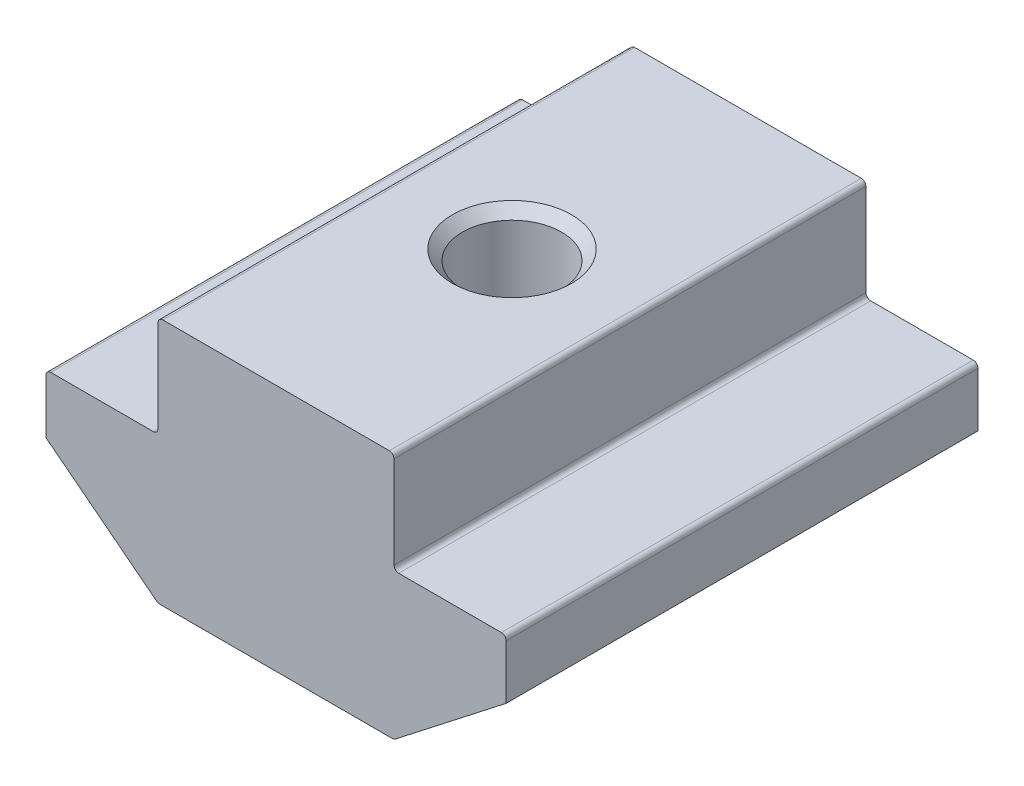
ISO-10303-21;
HEADER;
FILE_DESCRIPTION(('STEP AP214'),'2;1');
FILE_NAME('part.step','',(''),(''),'','','');
FILE_SCHEMA(('AUTOMOTIVE_DESIGN { 1 0 10303 214 1 1 1 1 }'));
ENDSEC;
DATA;
#1=APPLICATION_CONTEXT('core data for automotive mechanical design processes');
#2=APPLICATION_PROTOCOL_DEFINITION('international standard','automotive_design',2000,#1);
#3=PRODUCT_CONTEXT('',#1,'mechanical');
#4=PRODUCT('Part','Part','',(#3));
#5=PRODUCT_RELATED_PRODUCT_CATEGORY('part','',(#4));
#6=PRODUCT_DEFINITION_FORMATION('','',#4);
#7=PRODUCT_DEFINITION_CONTEXT('part definition',#1,'design');
#8=PRODUCT_DEFINITION('design','',#6,#7);
#9=PRODUCT_DEFINITION_SHAPE('','',#8);
#10=(LENGTH_UNIT() NAMED_UNIT(*) SI_UNIT(.MILLI.,.METRE.));
#11=(NAMED_UNIT(*) PLANE_ANGLE_UNIT() SI_UNIT($,.RADIAN.));
#12=(NAMED_UNIT(*) SI_UNIT($,.STERADIAN.) SOLID_ANGLE_UNIT());
#13=UNCERTAINTY_MEASURE_WITH_UNIT(LENGTH_MEASURE(1.E-05),#10,'distance_accuracy_value','');
#14=(GEOMETRIC_REPRESENTATION_CONTEXT(3) GLOBAL_UNCERTAINTY_ASSIGNED_CONTEXT((#13)) GLOBAL_UNIT_ASSIGNED_CONTEXT((#10,
#11,#12)) REPRESENTATION_CONTEXT('',''));
#15=CARTESIAN_POINT('',(0.,0.,0.));
#16=DIRECTION('',(0.,0.,1.));
#17=DIRECTION('',(1.,0.,0.));
#18=AXIS2_PLACEMENT_3D('',#15,#16,#17);
#19=CARTESIAN_POINT('',(-5.,0.,10.));
#20=DIRECTION('',(1.,0.,0.));
#21=DIRECTION('',(0.,1.,0.));
#22=AXIS2_PLACEMENT_3D('',#19,#20,#21);
#23=PLANE('',#22);
#24=DIRECTION('',(0.,-1.,0.));
#25=VECTOR('',#24,1.);
#26=CARTESIAN_POINT('',(-5.,0.,10.));
#27=LINE('',#26,#25);
#28=CARTESIAN_POINT('',(-5.,-0.200000000000003,10.));
#29=VERTEX_POINT('',#28);
#30=CARTESIAN_POINT('',(-5.,-4.1,10.));
#31=VERTEX_POINT('',#30);
#32=EDGE_CURVE('E234',#29,#31,#27,.T.);
#33=ORIENTED_EDGE('',*,*,#32,.F.);
#34=DIRECTION('',(0.,0.,-1.));
#35=VECTOR('',#34,1.);
#36=CARTESIAN_POINT('',(-5.,-0.200000000000003,10.));
#37=LINE('',#36,#35);
#38=CARTESIAN_POINT('',(-5.,-0.200000000000003,-10.));
#39=VERTEX_POINT('',#38);
#40=EDGE_CURVE('E285',#29,#39,#37,.T.);
#41=ORIENTED_EDGE('',*,*,#40,.T.);
#42=DIRECTION('',(0.,-1.,0.));
#43=VECTOR('',#42,1.);
#44=CARTESIAN_POINT('',(-5.,0.,-10.));
#45=LINE('',#44,#43);
#46=CARTESIAN_POINT('',(-5.,-4.1,-10.));
#47=VERTEX_POINT('',#46);
#48=EDGE_CURVE('E208',#39,#47,#45,.T.);
#49=ORIENTED_EDGE('',*,*,#48,.T.);
#50=DIRECTION('',(0.,0.,-1.));
#51=VECTOR('',#50,1.);
#52=CARTESIAN_POINT('',(-5.,-4.1,10.));
#53=LINE('',#52,#51);
#54=EDGE_CURVE('E283',#47,#31,#53,.F.);
#55=ORIENTED_EDGE('',*,*,#54,.T.);
#56=EDGE_LOOP('',(#33,#41,#49,#55));
#57=FACE_BOUND('',#56,.T.);
#58=ADVANCED_FACE('F37',(#57),#23,.F.);
#59=CARTESIAN_POINT('',(-5.,-4.3,10.));
#60=DIRECTION('',(0.,-1.,0.));
#61=DIRECTION('',(1.,0.,0.));
#62=AXIS2_PLACEMENT_3D('',#59,#60,#61);
#63=PLANE('',#62);
#64=DIRECTION('',(-1.,0.,0.));
#65=VECTOR('',#64,1.);
#66=CARTESIAN_POINT('',(-5.,-4.3,-10.));
#67=LINE('',#66,#65);
#68=CARTESIAN_POINT('',(-5.2,-4.3,-10.));
#69=VERTEX_POINT('',#68);
#70=CARTESIAN_POINT('',(-9.55,-4.3,-10.));
#71=VERTEX_POINT('',#70);
#72=EDGE_CURVE('E211',#69,#71,#67,.T.);
#73=ORIENTED_EDGE('',*,*,#72,.T.);
#74=DIRECTION('',(0.,0.,-1.));
#75=VECTOR('',#74,1.);
#76=CARTESIAN_POINT('',(-9.55,-4.3,10.));
#77=LINE('',#76,#75);
#78=CARTESIAN_POINT('',(-9.55,-4.3,10.));
#79=VERTEX_POINT('',#78);
#80=EDGE_CURVE('E293',#71,#79,#77,.F.);
#81=ORIENTED_EDGE('',*,*,#80,.T.);
#82=DIRECTION('',(-1.,0.,0.));
#83=VECTOR('',#82,1.);
#84=CARTESIAN_POINT('',(-5.,-4.3,10.));
#85=LINE('',#84,#83);
#86=CARTESIAN_POINT('',(-5.2,-4.3,10.));
#87=VERTEX_POINT('',#86);
#88=EDGE_CURVE('E175',#87,#79,#85,.T.);
#89=ORIENTED_EDGE('',*,*,#88,.F.);
#90=DIRECTION('',(0.,0.,-1.));
#91=VECTOR('',#90,1.);
#92=CARTESIAN_POINT('',(-5.2,-4.3,-10.));
#93=LINE('',#92,#91);
#94=EDGE_CURVE('E290',#87,#69,#93,.T.);
#95=ORIENTED_EDGE('',*,*,#94,.T.);
#96=EDGE_LOOP('',(#73,#81,#89,#95));
#97=FACE_BOUND('',#96,.T.);
#98=ADVANCED_FACE('F313',(#97),#63,.F.);
#99=CARTESIAN_POINT('',(-9.75,-4.3,10.));
#100=DIRECTION('',(1.,0.,0.));
#101=DIRECTION('',(0.,0.,-1.));
#102=AXIS2_PLACEMENT_3D('',#99,#100,#101);
#103=PLANE('',#102);
#104=DIRECTION('',(0.,-1.,0.));
#105=VECTOR('',#104,1.);
#106=CARTESIAN_POINT('',(-9.75,-4.3,10.));
#107=LINE('',#106,#105);
#108=CARTESIAN_POINT('',(-9.75,-4.5,10.));
#109=VERTEX_POINT('',#108);
#110=CARTESIAN_POINT('',(-9.75,-6.8,10.));
#111=VERTEX_POINT('',#110);
#112=EDGE_CURVE('E162',#109,#111,#107,.T.);
#113=ORIENTED_EDGE('',*,*,#112,.F.);
#114=DIRECTION('',(0.,0.,-1.));
#115=VECTOR('',#114,1.);
#116=CARTESIAN_POINT('',(-9.75,-4.5,10.));
#117=LINE('',#116,#115);
#118=CARTESIAN_POINT('',(-9.75,-4.5,-10.));
#119=VERTEX_POINT('',#118);
#120=EDGE_CURVE('E288',#109,#119,#117,.T.);
#121=ORIENTED_EDGE('',*,*,#120,.T.);
#122=DIRECTION('',(0.,-1.,0.));
#123=VECTOR('',#122,1.);
#124=CARTESIAN_POINT('',(-9.75,-4.3,-10.));
#125=LINE('',#124,#123);
#126=CARTESIAN_POINT('',(-9.75,-6.8,-10.));
#127=VERTEX_POINT('',#126);
#128=EDGE_CURVE('E181',#119,#127,#125,.T.);
#129=ORIENTED_EDGE('',*,*,#128,.T.);
#130=DIRECTION('',(0.,0.,-1.));
#131=VECTOR('',#130,1.);
#132=CARTESIAN_POINT('',(-9.75,-6.8,10.));
#133=LINE('',#132,#131);
#134=EDGE_CURVE('E178',#111,#127,#133,.T.);
#135=ORIENTED_EDGE('',*,*,#134,.F.);
#136=EDGE_LOOP('',(#113,#121,#129,#135));
#137=FACE_BOUND('',#136,.T.);
#138=ADVANCED_FACE('F179',(#137),#103,.F.);
#139=CARTESIAN_POINT('',(-9.75,-6.8,10.));
#140=DIRECTION('',(0.614515361098146,0.788904855463836,0.));
#141=DIRECTION('',(-0.788904855463836,0.614515361098146,0.));
#142=AXIS2_PLACEMENT_3D('',#139,#140,#141);
#143=PLANE('',#142);
#144=DIRECTION('',(0.788904855463836,-0.614515361098146,0.));
#145=VECTOR('',#144,1.);
#146=CARTESIAN_POINT('',(-9.75,-6.8,-10.));
#147=LINE('',#146,#145);
#148=CARTESIAN_POINT('',(-5.05420010467821,-10.4577809710928,-10.));
#149=VERTEX_POINT('',#148);
#150=EDGE_CURVE('E216',#127,#149,#147,.T.);
#151=ORIENTED_EDGE('',*,*,#150,.T.);
#152=DIRECTION('',(0.,0.,-1.));
#153=VECTOR('',#152,1.);
#154=CARTESIAN_POINT('',(-5.05420010467821,-10.4577809710928,10.));
#155=LINE('',#154,#153);
#156=CARTESIAN_POINT('',(-5.05420010467821,-10.4577809710928,10.));
#157=VERTEX_POINT('',#156);
#158=EDGE_CURVE('E190',#149,#157,#155,.F.);
#159=ORIENTED_EDGE('',*,*,#158,.T.);
#160=DIRECTION('',(0.788904855463836,-0.614515361098146,0.));
#161=VECTOR('',#160,1.);
#162=CARTESIAN_POINT('',(-9.75,-6.8,10.));
#163=LINE('',#162,#161);
#164=EDGE_CURVE('E167',#111,#157,#163,.T.);
#165=ORIENTED_EDGE('',*,*,#164,.F.);
#166=ORIENTED_EDGE('',*,*,#134,.T.);
#167=EDGE_LOOP('',(#151,#159,#165,#166));
#168=FACE_BOUND('',#167,.T.);
#169=ADVANCED_FACE('F188',(#168),#143,.F.);
#170=CARTESIAN_POINT('',(-5.,-10.5,10.));
#171=DIRECTION('',(0.,1.,0.));
#172=DIRECTION('',(0.,0.,1.));
#173=AXIS2_PLACEMENT_3D('',#170,#171,#172);
#174=PLANE('',#173);
#175=CARTESIAN_POINT('',(0.,-10.5,0.));
#176=DIRECTION('',(0.,1.,0.));
#177=DIRECTION('',(0.,0.,1.));
#178=AXIS2_PLACEMENT_3D('',#175,#176,#177);
#179=CIRCLE('',#178,2.525);
#180=CARTESIAN_POINT('',(0.,-10.5,2.525));
#181=VERTEX_POINT('',#180);
#182=EDGE_CURVE('E325',#181,#181,#179,.T.);
#183=ORIENTED_EDGE('',*,*,#182,.T.);
#184=EDGE_LOOP('',(#183));
#185=FACE_BOUND('',#184,.T.);
#186=DIRECTION('',(1.,0.,0.));
#187=VECTOR('',#186,1.);
#188=CARTESIAN_POINT('',(-5.,-10.5,-10.));
#189=LINE('',#188,#187);
#190=CARTESIAN_POINT('',(-4.93129703245858,-10.5,-10.));
#191=VERTEX_POINT('',#190);
#192=CARTESIAN_POINT('',(4.93129703245858,-10.5,-10.));
#193=VERTEX_POINT('',#192);
#194=EDGE_CURVE('E218',#191,#193,#189,.T.);
#195=ORIENTED_EDGE('',*,*,#194,.T.);
#196=DIRECTION('',(0.,0.,-1.));
#197=VECTOR('',#196,1.);
#198=CARTESIAN_POINT('',(4.93129703245858,-10.5,10.));
#199=LINE('',#198,#197);
#200=CARTESIAN_POINT('',(4.93129703245858,-10.5,10.));
#201=VERTEX_POINT('',#200);
#202=EDGE_CURVE('E254',#193,#201,#199,.F.);
#203=ORIENTED_EDGE('',*,*,#202,.T.);
#204=DIRECTION('',(1.,0.,0.));
#205=VECTOR('',#204,1.);
#206=CARTESIAN_POINT('',(-5.,-10.5,10.));
#207=LINE('',#206,#205);
#208=CARTESIAN_POINT('',(-4.93129703245858,-10.5,10.));
#209=VERTEX_POINT('',#208);
#210=EDGE_CURVE('E191',#209,#201,#207,.T.);
#211=ORIENTED_EDGE('',*,*,#210,.F.);
#212=DIRECTION('',(0.,0.,-1.));
#213=VECTOR('',#212,1.);
#214=CARTESIAN_POINT('',(-4.93129703245858,-10.5,10.));
#215=LINE('',#214,#213);
#216=EDGE_CURVE('E251',#209,#191,#215,.T.);
#217=ORIENTED_EDGE('',*,*,#216,.T.);
#218=EDGE_LOOP('',(#195,#203,#211,#217));
#219=FACE_BOUND('',#218,.T.);
#220=ADVANCED_FACE('F329',(#185,#219),#174,.F.);
#221=CARTESIAN_POINT('',(9.75,-6.8,10.));
#222=DIRECTION('',(-0.614515361098146,0.788904855463836,0.));
#223=DIRECTION('',(-0.788904855463836,-0.614515361098146,0.));
#224=AXIS2_PLACEMENT_3D('',#221,#222,#223);
#225=PLANE('',#224);
#226=DIRECTION('',(0.788904855463836,0.614515361098146,0.));
#227=VECTOR('',#226,1.);
#228=CARTESIAN_POINT('',(9.75,-6.8,10.));
#229=LINE('',#228,#227);
#230=CARTESIAN_POINT('',(5.05420010467821,-10.4577809710928,10.));
#231=VERTEX_POINT('',#230);
#232=CARTESIAN_POINT('',(9.75,-6.8,10.));
#233=VERTEX_POINT('',#232);
#234=EDGE_CURVE('E193',#231,#233,#229,.T.);
#235=ORIENTED_EDGE('',*,*,#234,.F.);
#236=DIRECTION('',(0.,0.,-1.));
#237=VECTOR('',#236,1.);
#238=CARTESIAN_POINT('',(5.05420010467821,-10.4577809710928,10.));
#239=LINE('',#238,#237);
#240=CARTESIAN_POINT('',(5.05420010467821,-10.4577809710928,-10.));
#241=VERTEX_POINT('',#240);
#242=EDGE_CURVE('E185',#231,#241,#239,.T.);
#243=ORIENTED_EDGE('',*,*,#242,.T.);
#244=DIRECTION('',(0.788904855463836,0.614515361098146,0.));
#245=VECTOR('',#244,1.);
#246=CARTESIAN_POINT('',(9.75,-6.8,-10.));
#247=LINE('',#246,#245);
#248=CARTESIAN_POINT('',(9.75,-6.8,-10.));
#249=VERTEX_POINT('',#248);
#250=EDGE_CURVE('E221',#241,#249,#247,.T.);
#251=ORIENTED_EDGE('',*,*,#250,.T.);
#252=DIRECTION('',(0.,0.,-1.));
#253=VECTOR('',#252,1.);
#254=CARTESIAN_POINT('',(9.75,-6.8,10.));
#255=LINE('',#254,#253);
#256=EDGE_CURVE('E186',#233,#249,#255,.T.);
#257=ORIENTED_EDGE('',*,*,#256,.F.);
#258=EDGE_LOOP('',(#235,#243,#251,#257));
#259=FACE_BOUND('',#258,.T.);
#260=ADVANCED_FACE('F385',(#259),#225,.F.);
#261=CARTESIAN_POINT('',(9.75,-4.3,10.));
#262=DIRECTION('',(-1.,0.,0.));
#263=DIRECTION('',(0.,0.,1.));
#264=AXIS2_PLACEMENT_3D('',#261,#262,#263);
#265=PLANE('',#264);
#266=DIRECTION('',(0.,1.,0.));
#267=VECTOR('',#266,1.);
#268=CARTESIAN_POINT('',(9.75,-4.3,-10.));
#269=LINE('',#268,#267);
#270=CARTESIAN_POINT('',(9.75,-4.5,-10.));
#271=VERTEX_POINT('',#270);
#272=EDGE_CURVE('E223',#249,#271,#269,.T.);
#273=ORIENTED_EDGE('',*,*,#272,.T.);
#274=DIRECTION('',(0.,0.,-1.));
#275=VECTOR('',#274,1.);
#276=CARTESIAN_POINT('',(9.75,-4.5,10.));
#277=LINE('',#276,#275);
#278=CARTESIAN_POINT('',(9.75,-4.5,10.));
#279=VERTEX_POINT('',#278);
#280=EDGE_CURVE('E272',#271,#279,#277,.F.);
#281=ORIENTED_EDGE('',*,*,#280,.T.);
#282=DIRECTION('',(0.,1.,0.));
#283=VECTOR('',#282,1.);
#284=CARTESIAN_POINT('',(9.75,-4.3,10.));
#285=LINE('',#284,#283);
#286=EDGE_CURVE('E198',#233,#279,#285,.T.);
#287=ORIENTED_EDGE('',*,*,#286,.F.);
#288=ORIENTED_EDGE('',*,*,#256,.T.);
#289=EDGE_LOOP('',(#273,#281,#287,#288));
#290=FACE_BOUND('',#289,.T.);
#291=ADVANCED_FACE('F380',(#290),#265,.F.);
#292=CARTESIAN_POINT('',(5.,-4.3,10.));
#293=DIRECTION('',(0.,-1.,0.));
#294=DIRECTION('',(1.,0.,0.));
#295=AXIS2_PLACEMENT_3D('',#292,#293,#294);
#296=PLANE('',#295);
#297=DIRECTION('',(-1.,0.,0.));
#298=VECTOR('',#297,1.);
#299=CARTESIAN_POINT('',(5.,-4.3,10.));
#300=LINE('',#299,#298);
#301=CARTESIAN_POINT('',(9.55,-4.3,10.));
#302=VERTEX_POINT('',#301);
#303=CARTESIAN_POINT('',(5.2,-4.3,10.));
#304=VERTEX_POINT('',#303);
#305=EDGE_CURVE('E201',#302,#304,#300,.T.);
#306=ORIENTED_EDGE('',*,*,#305,.F.);
#307=DIRECTION('',(0.,0.,-1.));
#308=VECTOR('',#307,1.);
#309=CARTESIAN_POINT('',(9.55,-4.3,10.));
#310=LINE('',#309,#308);
#311=CARTESIAN_POINT('',(9.55,-4.3,-10.));
#312=VERTEX_POINT('',#311);
#313=EDGE_CURVE('E269',#302,#312,#310,.T.);
#314=ORIENTED_EDGE('',*,*,#313,.T.);
#315=DIRECTION('',(-1.,0.,0.));
#316=VECTOR('',#315,1.);
#317=CARTESIAN_POINT('',(5.,-4.3,-10.));
#318=LINE('',#317,#316);
#319=CARTESIAN_POINT('',(5.2,-4.3,-10.));
#320=VERTEX_POINT('',#319);
#321=EDGE_CURVE('E226',#312,#320,#318,.T.);
#322=ORIENTED_EDGE('',*,*,#321,.T.);
#323=DIRECTION('',(0.,0.,-1.));
#324=VECTOR('',#323,1.);
#325=CARTESIAN_POINT('',(5.2,-4.3,10.));
#326=LINE('',#325,#324);
#327=EDGE_CURVE('E267',#320,#304,#326,.F.);
#328=ORIENTED_EDGE('',*,*,#327,.T.);
#329=EDGE_LOOP('',(#306,#314,#322,#328));
#330=FACE_BOUND('',#329,.T.);
#331=ADVANCED_FACE('F372',(#330),#296,.F.);
#332=CARTESIAN_POINT('',(5.,0.,10.));
#333=DIRECTION('',(-1.,0.,0.));
#334=DIRECTION('',(0.,-1.,0.));
#335=AXIS2_PLACEMENT_3D('',#332,#333,#334);
#336=PLANE('',#335);
#337=DIRECTION('',(0.,1.,0.));
#338=VECTOR('',#337,1.);
#339=CARTESIAN_POINT('',(5.,0.,10.));
#340=LINE('',#339,#338);
#341=CARTESIAN_POINT('',(5.,-4.1,10.));
#342=VERTEX_POINT('',#341);
#343=CARTESIAN_POINT('',(5.,-0.199999999999997,10.));
#344=VERTEX_POINT('',#343);
#345=EDGE_CURVE('E204',#342,#344,#340,.T.);
#346=ORIENTED_EDGE('',*,*,#345,.F.);
#347=DIRECTION('',(0.,0.,-1.));
#348=VECTOR('',#347,1.);
#349=CARTESIAN_POINT('',(5.,-4.1,-10.));
#350=LINE('',#349,#348);
#351=CARTESIAN_POINT('',(5.,-4.1,-10.));
#352=VERTEX_POINT('',#351);
#353=EDGE_CURVE('E276',#342,#352,#350,.T.);
#354=ORIENTED_EDGE('',*,*,#353,.T.);
#355=DIRECTION('',(0.,1.,0.));
#356=VECTOR('',#355,1.);
#357=CARTESIAN_POINT('',(5.,0.,-10.));
#358=LINE('',#357,#356);
#359=CARTESIAN_POINT('',(5.,-0.199999999999997,-10.));
#360=VERTEX_POINT('',#359);
#361=EDGE_CURVE('E229',#352,#360,#358,.T.);
#362=ORIENTED_EDGE('',*,*,#361,.T.);
#363=DIRECTION('',(0.,0.,-1.));
#364=VECTOR('',#363,1.);
#365=CARTESIAN_POINT('',(5.,-0.199999999999997,10.));
#366=LINE('',#365,#364);
#367=EDGE_CURVE('E274',#360,#344,#366,.F.);
#368=ORIENTED_EDGE('',*,*,#367,.T.);
#369=EDGE_LOOP('',(#346,#354,#362,#368));
#370=FACE_BOUND('',#369,.T.);
#371=ADVANCED_FACE('F353',(#370),#336,.F.);
#372=CARTESIAN_POINT('',(5.,0.,10.));
#373=DIRECTION('',(0.,-1.,0.));
#374=DIRECTION('',(1.,0.,0.));
#375=AXIS2_PLACEMENT_3D('',#372,#373,#374);
#376=PLANE('',#375);
#377=CARTESIAN_POINT('',(0.,0.,0.));
#378=DIRECTION('',(0.,1.,0.));
#379=DIRECTION('',(0.,0.,1.));
#380=AXIS2_PLACEMENT_3D('',#377,#378,#379);
#381=CIRCLE('',#380,2.525);
#382=CARTESIAN_POINT('',(0.,0.,2.525));
#383=VERTEX_POINT('',#382);
#384=EDGE_CURVE('E322',#383,#383,#381,.T.);
#385=ORIENTED_EDGE('',*,*,#384,.F.);
#386=EDGE_LOOP('',(#385));
#387=FACE_BOUND('',#386,.T.);
#388=DIRECTION('',(-1.,0.,0.));
#389=VECTOR('',#388,1.);
#390=CARTESIAN_POINT('',(5.,0.,10.));
#391=LINE('',#390,#389);
#392=CARTESIAN_POINT('',(4.8,0.,10.));
#393=VERTEX_POINT('',#392);
#394=CARTESIAN_POINT('',(-4.8,0.,10.));
#395=VERTEX_POINT('',#394);
#396=EDGE_CURVE('E206',#393,#395,#391,.T.);
#397=ORIENTED_EDGE('',*,*,#396,.F.);
#398=DIRECTION('',(0.,0.,-1.));
#399=VECTOR('',#398,1.);
#400=CARTESIAN_POINT('',(4.8,0.,10.));
#401=LINE('',#400,#399);
#402=CARTESIAN_POINT('',(4.8,0.,-10.));
#403=VERTEX_POINT('',#402);
#404=EDGE_CURVE('E280',#393,#403,#401,.T.);
#405=ORIENTED_EDGE('',*,*,#404,.T.);
#406=DIRECTION('',(-1.,0.,0.));
#407=VECTOR('',#406,1.);
#408=CARTESIAN_POINT('',(5.,0.,-10.));
#409=LINE('',#408,#407);
#410=CARTESIAN_POINT('',(-4.8,0.,-10.));
#411=VERTEX_POINT('',#410);
#412=EDGE_CURVE('E232',#403,#411,#409,.T.);
#413=ORIENTED_EDGE('',*,*,#412,.T.);
#414=DIRECTION('',(0.,0.,-1.));
#415=VECTOR('',#414,1.);
#416=CARTESIAN_POINT('',(-4.8,0.,10.));
#417=LINE('',#416,#415);
#418=EDGE_CURVE('E52',#411,#395,#417,.F.);
#419=ORIENTED_EDGE('',*,*,#418,.T.);
#420=EDGE_LOOP('',(#397,#405,#413,#419));
#421=FACE_BOUND('',#420,.T.);
#422=ADVANCED_FACE('F351',(#387,#421),#376,.F.);
#423=CARTESIAN_POINT('',(0.,0.,10.));
#424=DIRECTION('',(0.,0.,-1.));
#425=DIRECTION('',(-1.,0.,0.));
#426=AXIS2_PLACEMENT_3D('',#423,#424,#425);
#427=PLANE('',#426);
#428=ORIENTED_EDGE('',*,*,#210,.T.);
#429=CARTESIAN_POINT('',(4.93129703245858,-10.3,10.));
#430=DIRECTION('',(0.,0.,-1.));
#431=DIRECTION('',(-1.,0.,0.));
#432=AXIS2_PLACEMENT_3D('',#429,#430,#431);
#433=CIRCLE('',#432,0.2);
#434=EDGE_CURVE('E264',#201,#231,#433,.F.);
#435=ORIENTED_EDGE('',*,*,#434,.T.);
#436=ORIENTED_EDGE('',*,*,#234,.T.);
#437=ORIENTED_EDGE('',*,*,#286,.T.);
#438=CARTESIAN_POINT('',(9.55,-4.5,10.));
#439=DIRECTION('',(0.,0.,-1.));
#440=DIRECTION('',(-1.,0.,0.));
#441=AXIS2_PLACEMENT_3D('',#438,#439,#440);
#442=CIRCLE('',#441,0.2);
#443=EDGE_CURVE('E260',#279,#302,#442,.F.);
#444=ORIENTED_EDGE('',*,*,#443,.T.);
#445=ORIENTED_EDGE('',*,*,#305,.T.);
#446=CARTESIAN_POINT('',(5.2,-4.1,10.));
#447=DIRECTION('',(0.,0.,-1.));
#448=DIRECTION('',(-1.,0.,0.));
#449=AXIS2_PLACEMENT_3D('',#446,#447,#448);
#450=CIRCLE('',#449,0.2);
#451=EDGE_CURVE('E297',#304,#342,#450,.T.);
#452=ORIENTED_EDGE('',*,*,#451,.T.);
#453=ORIENTED_EDGE('',*,*,#345,.T.);
#454=CARTESIAN_POINT('',(4.8,-0.199999999999998,10.));
#455=DIRECTION('',(0.,0.,-1.));
#456=DIRECTION('',(-1.,0.,0.));
#457=AXIS2_PLACEMENT_3D('',#454,#455,#456);
#458=CIRCLE('',#457,0.2);
#459=EDGE_CURVE('E59',#344,#393,#458,.F.);
#460=ORIENTED_EDGE('',*,*,#459,.T.);
#461=ORIENTED_EDGE('',*,*,#396,.T.);
#462=CARTESIAN_POINT('',(-4.8,-0.200000000000003,10.));
#463=DIRECTION('',(0.,0.,-1.));
#464=DIRECTION('',(-1.,0.,0.));
#465=AXIS2_PLACEMENT_3D('',#462,#463,#464);
#466=CIRCLE('',#465,0.2);
#467=EDGE_CURVE('E257',#395,#29,#466,.F.);
#468=ORIENTED_EDGE('',*,*,#467,.T.);
#469=ORIENTED_EDGE('',*,*,#32,.T.);
#470=CARTESIAN_POINT('',(-5.2,-4.1,10.));
#471=DIRECTION('',(0.,0.,-1.));
#472=DIRECTION('',(-1.,0.,0.));
#473=AXIS2_PLACEMENT_3D('',#470,#471,#472);
#474=CIRCLE('',#473,0.2);
#475=EDGE_CURVE('E11',#31,#87,#474,.T.);
#476=ORIENTED_EDGE('',*,*,#475,.T.);
#477=ORIENTED_EDGE('',*,*,#88,.T.);
#478=CARTESIAN_POINT('',(-9.55,-4.5,10.));
#479=DIRECTION('',(0.,0.,-1.));
#480=DIRECTION('',(-1.,0.,0.));
#481=AXIS2_PLACEMENT_3D('',#478,#479,#480);
#482=CIRCLE('',#481,0.2);
#483=EDGE_CURVE('E171',#79,#109,#482,.F.);
#484=ORIENTED_EDGE('',*,*,#483,.T.);
#485=ORIENTED_EDGE('',*,*,#112,.T.);
#486=ORIENTED_EDGE('',*,*,#164,.T.);
#487=CARTESIAN_POINT('',(-4.93129703245858,-10.3,10.));
#488=DIRECTION('',(0.,0.,-1.));
#489=DIRECTION('',(-1.,0.,0.));
#490=AXIS2_PLACEMENT_3D('',#487,#488,#489);
#491=CIRCLE('',#490,0.2);
#492=EDGE_CURVE('E262',#157,#209,#491,.F.);
#493=ORIENTED_EDGE('',*,*,#492,.T.);
#494=EDGE_LOOP('',(#428,#435,#436,#437,#444,#445,#452,#453,#460,#461,#468,#469,#476,#477,#484,
#485,#486,#493));
#495=FACE_BOUND('',#494,.T.);
#496=ADVANCED_FACE('F165',(#495),#427,.F.);
#497=CARTESIAN_POINT('',(0.,0.,-10.));
#498=DIRECTION('',(0.,0.,-1.));
#499=DIRECTION('',(-1.,0.,0.));
#500=AXIS2_PLACEMENT_3D('',#497,#498,#499);
#501=PLANE('',#500);
#502=ORIENTED_EDGE('',*,*,#250,.F.);
#503=CARTESIAN_POINT('',(4.93129703245858,-10.3,-10.));
#504=DIRECTION('',(0.,0.,-1.));
#505=DIRECTION('',(-1.,0.,0.));
#506=AXIS2_PLACEMENT_3D('',#503,#504,#505);
#507=CIRCLE('',#506,0.2);
#508=EDGE_CURVE('E249',#241,#193,#507,.T.);
#509=ORIENTED_EDGE('',*,*,#508,.T.);
#510=ORIENTED_EDGE('',*,*,#194,.F.);
#511=CARTESIAN_POINT('',(-4.93129703245858,-10.3,-10.));
#512=DIRECTION('',(0.,0.,-1.));
#513=DIRECTION('',(-1.,0.,0.));
#514=AXIS2_PLACEMENT_3D('',#511,#512,#513);
#515=CIRCLE('',#514,0.2);
#516=EDGE_CURVE('E247',#191,#149,#515,.T.);
#517=ORIENTED_EDGE('',*,*,#516,.T.);
#518=ORIENTED_EDGE('',*,*,#150,.F.);
#519=ORIENTED_EDGE('',*,*,#128,.F.);
#520=CARTESIAN_POINT('',(-9.55,-4.5,-10.));
#521=DIRECTION('',(0.,0.,-1.));
#522=DIRECTION('',(-1.,0.,0.));
#523=AXIS2_PLACEMENT_3D('',#520,#521,#522);
#524=CIRCLE('',#523,0.2);
#525=EDGE_CURVE('E239',#119,#71,#524,.T.);
#526=ORIENTED_EDGE('',*,*,#525,.T.);
#527=ORIENTED_EDGE('',*,*,#72,.F.);
#528=CARTESIAN_POINT('',(-5.2,-4.1,-10.));
#529=DIRECTION('',(0.,0.,-1.));
#530=DIRECTION('',(-1.,0.,0.));
#531=AXIS2_PLACEMENT_3D('',#528,#529,#530);
#532=CIRCLE('',#531,0.2);
#533=EDGE_CURVE('E45',#69,#47,#532,.F.);
#534=ORIENTED_EDGE('',*,*,#533,.T.);
#535=ORIENTED_EDGE('',*,*,#48,.F.);
#536=CARTESIAN_POINT('',(-4.8,-0.200000000000003,-10.));
#537=DIRECTION('',(0.,0.,-1.));
#538=DIRECTION('',(-1.,0.,0.));
#539=AXIS2_PLACEMENT_3D('',#536,#537,#538);
#540=CIRCLE('',#539,0.2);
#541=EDGE_CURVE('E241',#39,#411,#540,.T.);
#542=ORIENTED_EDGE('',*,*,#541,.T.);
#543=ORIENTED_EDGE('',*,*,#412,.F.);
#544=CARTESIAN_POINT('',(4.8,-0.199999999999998,-10.));
#545=DIRECTION('',(0.,0.,-1.));
#546=DIRECTION('',(-1.,0.,0.));
#547=AXIS2_PLACEMENT_3D('',#544,#545,#546);
#548=CIRCLE('',#547,0.2);
#549=EDGE_CURVE('E243',#403,#360,#548,.T.);
#550=ORIENTED_EDGE('',*,*,#549,.T.);
#551=ORIENTED_EDGE('',*,*,#361,.F.);
#552=CARTESIAN_POINT('',(5.2,-4.1,-10.));
#553=DIRECTION('',(0.,0.,-1.));
#554=DIRECTION('',(-1.,0.,0.));
#555=AXIS2_PLACEMENT_3D('',#552,#553,#554);
#556=CIRCLE('',#555,0.2);
#557=EDGE_CURVE('E295',#352,#320,#556,.F.);
#558=ORIENTED_EDGE('',*,*,#557,.T.);
#559=ORIENTED_EDGE('',*,*,#321,.F.);
#560=CARTESIAN_POINT('',(9.55,-4.5,-10.));
#561=DIRECTION('',(0.,0.,-1.));
#562=DIRECTION('',(-1.,0.,0.));
#563=AXIS2_PLACEMENT_3D('',#560,#561,#562);
#564=CIRCLE('',#563,0.2);
#565=EDGE_CURVE('E245',#312,#271,#564,.T.);
#566=ORIENTED_EDGE('',*,*,#565,.T.);
#567=ORIENTED_EDGE('',*,*,#272,.F.);
#568=EDGE_LOOP('',(#502,#509,#510,#517,#518,#519,#526,#527,#534,#535,#542,#543,#550,#551,#558,
#559,#566,#567));
#569=FACE_BOUND('',#568,.T.);
#570=ADVANCED_FACE('F302',(#569),#501,.T.);
#571=CARTESIAN_POINT('',(0.,-10.075,0.));
#572=DIRECTION('',(0.,-1.,0.));
#573=DIRECTION('',(0.,0.,-1.));
#574=AXIS2_PLACEMENT_3D('',#571,#572,#573);
#575=CONICAL_SURFACE('',#574,2.1,0.785398163397447);
#576=ORIENTED_EDGE('',*,*,#182,.F.);
#577=EDGE_LOOP('',(#576));
#578=FACE_BOUND('',#577,.T.);
#579=CARTESIAN_POINT('',(0.,-10.075,0.));
#580=DIRECTION('',(0.,1.,0.));
#581=DIRECTION('',(0.,0.,1.));
#582=AXIS2_PLACEMENT_3D('',#579,#580,#581);
#583=CIRCLE('',#582,2.1);
#584=CARTESIAN_POINT('',(0.,-10.075,2.1));
#585=VERTEX_POINT('',#584);
#586=EDGE_CURVE('E212',#585,#585,#583,.T.);
#587=ORIENTED_EDGE('',*,*,#586,.T.);
#588=EDGE_LOOP('',(#587));
#589=FACE_BOUND('',#588,.T.);
#590=ADVANCED_FACE('F332',(#578,#589),#575,.F.);
#591=CARTESIAN_POINT('',(0.,0.,0.));
#592=DIRECTION('',(0.,1.,0.));
#593=DIRECTION('',(0.,0.,1.));
#594=AXIS2_PLACEMENT_3D('',#591,#592,#593);
#595=CYLINDRICAL_SURFACE('',#594,2.1);
#596=ORIENTED_EDGE('',*,*,#586,.F.);
#597=EDGE_LOOP('',(#596));
#598=FACE_BOUND('',#597,.T.);
#599=CARTESIAN_POINT('',(0.,-0.424999999999999,0.));
#600=DIRECTION('',(0.,1.,0.));
#601=DIRECTION('',(0.,0.,1.));
#602=AXIS2_PLACEMENT_3D('',#599,#600,#601);
#603=CIRCLE('',#602,2.1);
#604=CARTESIAN_POINT('',(0.,-0.424999999999999,2.1));
#605=VERTEX_POINT('',#604);
#606=EDGE_CURVE('E319',#605,#605,#603,.T.);
#607=ORIENTED_EDGE('',*,*,#606,.T.);
#608=EDGE_LOOP('',(#607));
#609=FACE_BOUND('',#608,.T.);
#610=ADVANCED_FACE('F335',(#598,#609),#595,.F.);
#611=CARTESIAN_POINT('',(0.,0.,0.));
#612=DIRECTION('',(0.,1.,0.));
#613=DIRECTION('',(0.,0.,1.));
#614=AXIS2_PLACEMENT_3D('',#611,#612,#613);
#615=CONICAL_SURFACE('',#614,2.525,0.78539816339745);
#616=ORIENTED_EDGE('',*,*,#606,.F.);
#617=EDGE_LOOP('',(#616));
#618=FACE_BOUND('',#617,.T.);
#619=ORIENTED_EDGE('',*,*,#384,.T.);
#620=EDGE_LOOP('',(#619));
#621=FACE_BOUND('',#620,.T.);
#622=ADVANCED_FACE('F341',(#618,#621),#615,.F.);
#623=CARTESIAN_POINT('',(4.93129703245858,-10.3,10.));
#624=DIRECTION('',(0.,0.,-1.));
#625=DIRECTION('',(-1.,0.,0.));
#626=AXIS2_PLACEMENT_3D('',#623,#624,#625);
#627=CYLINDRICAL_SURFACE('',#626,0.2);
#628=ORIENTED_EDGE('',*,*,#434,.F.);
#629=ORIENTED_EDGE('',*,*,#202,.F.);
#630=ORIENTED_EDGE('',*,*,#508,.F.);
#631=ORIENTED_EDGE('',*,*,#242,.F.);
#632=EDGE_LOOP('',(#628,#629,#630,#631));
#633=FACE_BOUND('',#632,.T.);
#634=ADVANCED_FACE('F347',(#633),#627,.T.);
#635=CARTESIAN_POINT('',(-4.93129703245858,-10.3,10.));
#636=DIRECTION('',(0.,0.,-1.));
#637=DIRECTION('',(-1.,0.,0.));
#638=AXIS2_PLACEMENT_3D('',#635,#636,#637);
#639=CYLINDRICAL_SURFACE('',#638,0.2);
#640=ORIENTED_EDGE('',*,*,#492,.F.);
#641=ORIENTED_EDGE('',*,*,#158,.F.);
#642=ORIENTED_EDGE('',*,*,#516,.F.);
#643=ORIENTED_EDGE('',*,*,#216,.F.);
#644=EDGE_LOOP('',(#640,#641,#642,#643));
#645=FACE_BOUND('',#644,.T.);
#646=ADVANCED_FACE('F394',(#645),#639,.T.);
#647=CARTESIAN_POINT('',(9.55,-4.5,10.));
#648=DIRECTION('',(0.,0.,-1.));
#649=DIRECTION('',(-1.,0.,0.));
#650=AXIS2_PLACEMENT_3D('',#647,#648,#649);
#651=CYLINDRICAL_SURFACE('',#650,0.2);
#652=ORIENTED_EDGE('',*,*,#443,.F.);
#653=ORIENTED_EDGE('',*,*,#280,.F.);
#654=ORIENTED_EDGE('',*,*,#565,.F.);
#655=ORIENTED_EDGE('',*,*,#313,.F.);
#656=EDGE_LOOP('',(#652,#653,#654,#655));
#657=FACE_BOUND('',#656,.T.);
#658=ADVANCED_FACE('F376',(#657),#651,.T.);
#659=CARTESIAN_POINT('',(5.2,-4.1,10.));
#660=DIRECTION('',(0.,0.,1.));
#661=DIRECTION('',(1.,0.,0.));
#662=AXIS2_PLACEMENT_3D('',#659,#660,#661);
#663=CYLINDRICAL_SURFACE('',#662,0.2);
#664=ORIENTED_EDGE('',*,*,#451,.F.);
#665=ORIENTED_EDGE('',*,*,#327,.F.);
#666=ORIENTED_EDGE('',*,*,#557,.F.);
#667=ORIENTED_EDGE('',*,*,#353,.F.);
#668=EDGE_LOOP('',(#664,#665,#666,#667));
#669=FACE_BOUND('',#668,.T.);
#670=ADVANCED_FACE('F367',(#669),#663,.F.);
#671=CARTESIAN_POINT('',(4.8,-0.199999999999998,10.));
#672=DIRECTION('',(0.,0.,-1.));
#673=DIRECTION('',(-1.,0.,0.));
#674=AXIS2_PLACEMENT_3D('',#671,#672,#673);
#675=CYLINDRICAL_SURFACE('',#674,0.2);
#676=ORIENTED_EDGE('',*,*,#459,.F.);
#677=ORIENTED_EDGE('',*,*,#367,.F.);
#678=ORIENTED_EDGE('',*,*,#549,.F.);
#679=ORIENTED_EDGE('',*,*,#404,.F.);
#680=EDGE_LOOP('',(#676,#677,#678,#679));
#681=FACE_BOUND('',#680,.T.);
#682=ADVANCED_FACE('F359',(#681),#675,.T.);
#683=CARTESIAN_POINT('',(-4.8,-0.200000000000003,10.));
#684=DIRECTION('',(0.,0.,-1.));
#685=DIRECTION('',(-1.,0.,0.));
#686=AXIS2_PLACEMENT_3D('',#683,#684,#685);
#687=CYLINDRICAL_SURFACE('',#686,0.2);
#688=ORIENTED_EDGE('',*,*,#467,.F.);
#689=ORIENTED_EDGE('',*,*,#418,.F.);
#690=ORIENTED_EDGE('',*,*,#541,.F.);
#691=ORIENTED_EDGE('',*,*,#40,.F.);
#692=EDGE_LOOP('',(#688,#689,#690,#691));
#693=FACE_BOUND('',#692,.T.);
#694=ADVANCED_FACE('F398',(#693),#687,.T.);
#695=CARTESIAN_POINT('',(-9.55,-4.5,10.));
#696=DIRECTION('',(0.,0.,-1.));
#697=DIRECTION('',(-1.,0.,0.));
#698=AXIS2_PLACEMENT_3D('',#695,#696,#697);
#699=CYLINDRICAL_SURFACE('',#698,0.2);
#700=ORIENTED_EDGE('',*,*,#483,.F.);
#701=ORIENTED_EDGE('',*,*,#80,.F.);
#702=ORIENTED_EDGE('',*,*,#525,.F.);
#703=ORIENTED_EDGE('',*,*,#120,.F.);
#704=EDGE_LOOP('',(#700,#701,#702,#703));
#705=FACE_BOUND('',#704,.T.);
#706=ADVANCED_FACE('F396',(#705),#699,.T.);
#707=CARTESIAN_POINT('',(-5.2,-4.1,10.));
#708=DIRECTION('',(0.,0.,1.));
#709=DIRECTION('',(1.,0.,0.));
#710=AXIS2_PLACEMENT_3D('',#707,#708,#709);
#711=CYLINDRICAL_SURFACE('',#710,0.2);
#712=ORIENTED_EDGE('',*,*,#475,.F.);
#713=ORIENTED_EDGE('',*,*,#54,.F.);
#714=ORIENTED_EDGE('',*,*,#533,.F.);
#715=ORIENTED_EDGE('',*,*,#94,.F.);
#716=EDGE_LOOP('',(#712,#713,#714,#715));
#717=FACE_BOUND('',#716,.T.);
#718=ADVANCED_FACE('F39',(#717),#711,.F.);
#719=CLOSED_SHELL('',(#58,#98,#138,#169,#220,#260,#291,#331,#371,#422,#496,#570,#590,#610,#622,
#634,#646,#658,#670,#682,#694,#706,#718));
#720=MANIFOLD_SOLID_BREP('B2',#719);
#721=ADVANCED_BREP_SHAPE_REPRESENTATION('',(#18,#720),#14);
#722=SHAPE_DEFINITION_REPRESENTATION(#9,#721);
ENDSEC;
END-ISO-10303-21;
